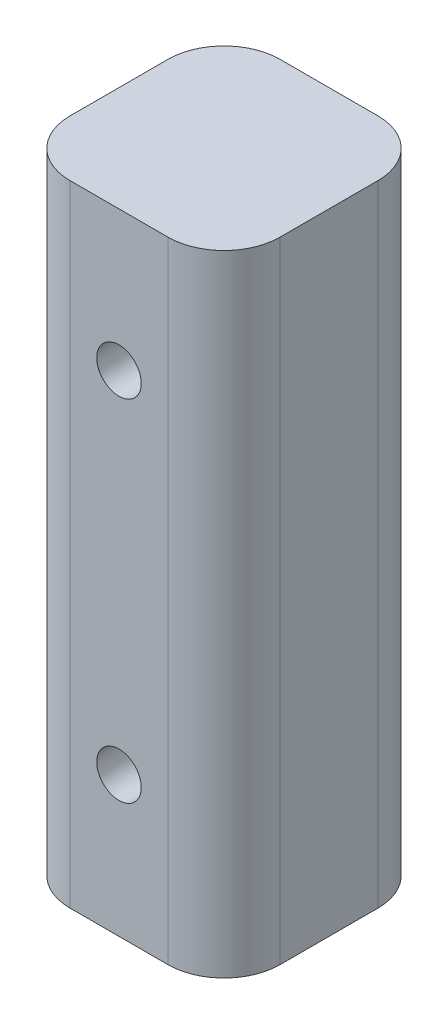
ISO-10303-21;
HEADER;
FILE_DESCRIPTION(('STEP AP214'),'2;1');
FILE_NAME('part.step','',(''),(''),'','','');
FILE_SCHEMA(('AUTOMOTIVE_DESIGN { 1 0 10303 214 1 1 1 1 }'));
ENDSEC;
DATA;
#1=APPLICATION_CONTEXT('core data for automotive mechanical design processes');
#2=APPLICATION_PROTOCOL_DEFINITION('international standard','automotive_design',2000,#1);
#3=PRODUCT_CONTEXT('',#1,'mechanical');
#4=PRODUCT('Part','Part','',(#3));
#5=PRODUCT_RELATED_PRODUCT_CATEGORY('part','',(#4));
#6=PRODUCT_DEFINITION_FORMATION('','',#4);
#7=PRODUCT_DEFINITION_CONTEXT('part definition',#1,'design');
#8=PRODUCT_DEFINITION('design','',#6,#7);
#9=PRODUCT_DEFINITION_SHAPE('','',#8);
#10=(LENGTH_UNIT() NAMED_UNIT(*) SI_UNIT(.MILLI.,.METRE.));
#11=(NAMED_UNIT(*) PLANE_ANGLE_UNIT() SI_UNIT($,.RADIAN.));
#12=(NAMED_UNIT(*) SI_UNIT($,.STERADIAN.) SOLID_ANGLE_UNIT());
#13=UNCERTAINTY_MEASURE_WITH_UNIT(LENGTH_MEASURE(1.E-05),#10,'distance_accuracy_value','');
#14=(GEOMETRIC_REPRESENTATION_CONTEXT(3) GLOBAL_UNCERTAINTY_ASSIGNED_CONTEXT((#13)) GLOBAL_UNIT_ASSIGNED_CONTEXT((#10,
#11,#12)) REPRESENTATION_CONTEXT('',''));
#15=CARTESIAN_POINT('',(0.,0.,0.));
#16=DIRECTION('',(0.,0.,1.));
#17=DIRECTION('',(1.,0.,0.));
#18=AXIS2_PLACEMENT_3D('',#15,#16,#17);
#19=CARTESIAN_POINT('',(-4.445,57.15,-4.445));
#20=DIRECTION('',(0.,-1.,0.));
#21=DIRECTION('',(0.,0.,-1.));
#22=AXIS2_PLACEMENT_3D('',#19,#20,#21);
#23=CYLINDRICAL_SURFACE('',#22,5.08);
#24=CARTESIAN_POINT('',(-4.445,0.,-4.445));
#25=DIRECTION('',(0.,1.,0.));
#26=DIRECTION('',(0.,0.,1.));
#27=AXIS2_PLACEMENT_3D('',#24,#25,#26);
#28=CIRCLE('',#27,5.08);
#29=CARTESIAN_POINT('',(-4.445,0.,-9.525));
#30=VERTEX_POINT('',#29);
#31=CARTESIAN_POINT('',(-9.525,0.,-4.445));
#32=VERTEX_POINT('',#31);
#33=EDGE_CURVE('E131',#30,#32,#28,.T.);
#34=ORIENTED_EDGE('',*,*,#33,.T.);
#35=DIRECTION('',(0.,-1.,0.));
#36=VECTOR('',#35,1.);
#37=CARTESIAN_POINT('',(-9.525,57.15,-4.445));
#38=LINE('',#37,#36);
#39=CARTESIAN_POINT('',(-9.525,57.15,-4.445));
#40=VERTEX_POINT('',#39);
#41=EDGE_CURVE('E11',#40,#32,#38,.T.);
#42=ORIENTED_EDGE('',*,*,#41,.F.);
#43=CARTESIAN_POINT('',(-4.445,57.15,-4.445));
#44=DIRECTION('',(0.,1.,0.));
#45=DIRECTION('',(0.,0.,1.));
#46=AXIS2_PLACEMENT_3D('',#43,#44,#45);
#47=CIRCLE('',#46,5.08);
#48=CARTESIAN_POINT('',(-4.445,57.15,-9.525));
#49=VERTEX_POINT('',#48);
#50=EDGE_CURVE('E146',#49,#40,#47,.T.);
#51=ORIENTED_EDGE('',*,*,#50,.F.);
#52=DIRECTION('',(0.,-1.,0.));
#53=VECTOR('',#52,1.);
#54=CARTESIAN_POINT('',(-4.445,57.15,-9.525));
#55=LINE('',#54,#53);
#56=EDGE_CURVE('E127',#49,#30,#55,.T.);
#57=ORIENTED_EDGE('',*,*,#56,.T.);
#58=EDGE_LOOP('',(#34,#42,#51,#57));
#59=FACE_BOUND('',#58,.T.);
#60=ADVANCED_FACE('F35',(#59),#23,.T.);
#61=CARTESIAN_POINT('',(-9.525,57.15,-4.445));
#62=DIRECTION('',(1.,0.,0.));
#63=DIRECTION('',(0.,0.,-1.));
#64=AXIS2_PLACEMENT_3D('',#61,#62,#63);
#65=PLANE('',#64);
#66=DIRECTION('',(0.,0.,1.));
#67=VECTOR('',#66,1.);
#68=CARTESIAN_POINT('',(-9.525,0.,-4.445));
#69=LINE('',#68,#67);
#70=CARTESIAN_POINT('',(-9.525,0.,4.445));
#71=VERTEX_POINT('',#70);
#72=EDGE_CURVE('E134',#32,#71,#69,.T.);
#73=ORIENTED_EDGE('',*,*,#72,.T.);
#74=DIRECTION('',(0.,-1.,0.));
#75=VECTOR('',#74,1.);
#76=CARTESIAN_POINT('',(-9.525,57.15,4.445));
#77=LINE('',#76,#75);
#78=CARTESIAN_POINT('',(-9.525,57.15,4.445));
#79=VERTEX_POINT('',#78);
#80=EDGE_CURVE('E43',#79,#71,#77,.T.);
#81=ORIENTED_EDGE('',*,*,#80,.F.);
#82=DIRECTION('',(0.,0.,1.));
#83=VECTOR('',#82,1.);
#84=CARTESIAN_POINT('',(-9.525,57.15,-4.445));
#85=LINE('',#84,#83);
#86=EDGE_CURVE('E94',#40,#79,#85,.T.);
#87=ORIENTED_EDGE('',*,*,#86,.F.);
#88=ORIENTED_EDGE('',*,*,#41,.T.);
#89=EDGE_LOOP('',(#73,#81,#87,#88));
#90=FACE_BOUND('',#89,.T.);
#91=ADVANCED_FACE('F212',(#90),#65,.F.);
#92=CARTESIAN_POINT('',(-4.445,57.15,4.445));
#93=DIRECTION('',(0.,-1.,0.));
#94=DIRECTION('',(0.,0.,-1.));
#95=AXIS2_PLACEMENT_3D('',#92,#93,#94);
#96=CYLINDRICAL_SURFACE('',#95,5.08);
#97=CARTESIAN_POINT('',(-4.445,0.,4.445));
#98=DIRECTION('',(0.,1.,0.));
#99=DIRECTION('',(0.,0.,1.));
#100=AXIS2_PLACEMENT_3D('',#97,#98,#99);
#101=CIRCLE('',#100,5.08);
#102=CARTESIAN_POINT('',(-4.445,0.,9.525));
#103=VERTEX_POINT('',#102);
#104=EDGE_CURVE('E137',#71,#103,#101,.T.);
#105=ORIENTED_EDGE('',*,*,#104,.T.);
#106=DIRECTION('',(0.,-1.,0.));
#107=VECTOR('',#106,1.);
#108=CARTESIAN_POINT('',(-4.445,57.15,9.525));
#109=LINE('',#108,#107);
#110=CARTESIAN_POINT('',(-4.445,57.15,9.525));
#111=VERTEX_POINT('',#110);
#112=EDGE_CURVE('E153',#111,#103,#109,.T.);
#113=ORIENTED_EDGE('',*,*,#112,.F.);
#114=CARTESIAN_POINT('',(-4.445,57.15,4.445));
#115=DIRECTION('',(0.,1.,0.));
#116=DIRECTION('',(0.,0.,1.));
#117=AXIS2_PLACEMENT_3D('',#114,#115,#116);
#118=CIRCLE('',#117,5.08);
#119=EDGE_CURVE('E161',#79,#111,#118,.T.);
#120=ORIENTED_EDGE('',*,*,#119,.F.);
#121=ORIENTED_EDGE('',*,*,#80,.T.);
#122=EDGE_LOOP('',(#105,#113,#120,#121));
#123=FACE_BOUND('',#122,.T.);
#124=ADVANCED_FACE('F159',(#123),#96,.T.);
#125=CARTESIAN_POINT('',(-4.445,57.15,9.525));
#126=DIRECTION('',(0.,0.,-1.));
#127=DIRECTION('',(-1.,0.,0.));
#128=AXIS2_PLACEMENT_3D('',#125,#126,#127);
#129=PLANE('',#128);
#130=CARTESIAN_POINT('',(0.,44.45,9.525));
#131=DIRECTION('',(0.,0.,1.));
#132=DIRECTION('',(1.,0.,0.));
#133=AXIS2_PLACEMENT_3D('',#130,#131,#132);
#134=CIRCLE('',#133,2.01929999999999);
#135=CARTESIAN_POINT('',(2.01929999999999,44.45,9.525));
#136=VERTEX_POINT('',#135);
#137=EDGE_CURVE('E187',#136,#136,#134,.T.);
#138=ORIENTED_EDGE('',*,*,#137,.F.);
#139=EDGE_LOOP('',(#138));
#140=FACE_BOUND('',#139,.T.);
#141=CARTESIAN_POINT('',(0.,12.7,9.525));
#142=DIRECTION('',(0.,0.,1.));
#143=DIRECTION('',(1.,0.,0.));
#144=AXIS2_PLACEMENT_3D('',#141,#142,#143);
#145=CIRCLE('',#144,2.01929999999999);
#146=CARTESIAN_POINT('',(2.01929999999999,12.7,9.525));
#147=VERTEX_POINT('',#146);
#148=EDGE_CURVE('E181',#147,#147,#145,.T.);
#149=ORIENTED_EDGE('',*,*,#148,.F.);
#150=EDGE_LOOP('',(#149));
#151=FACE_BOUND('',#150,.T.);
#152=DIRECTION('',(1.,0.,0.));
#153=VECTOR('',#152,1.);
#154=CARTESIAN_POINT('',(-4.445,0.,9.525));
#155=LINE('',#154,#153);
#156=CARTESIAN_POINT('',(4.445,0.,9.525));
#157=VERTEX_POINT('',#156);
#158=EDGE_CURVE('E139',#103,#157,#155,.T.);
#159=ORIENTED_EDGE('',*,*,#158,.T.);
#160=DIRECTION('',(0.,-1.,0.));
#161=VECTOR('',#160,1.);
#162=CARTESIAN_POINT('',(4.445,57.15,9.525));
#163=LINE('',#162,#161);
#164=CARTESIAN_POINT('',(4.445,57.15,9.525));
#165=VERTEX_POINT('',#164);
#166=EDGE_CURVE('E150',#165,#157,#163,.T.);
#167=ORIENTED_EDGE('',*,*,#166,.F.);
#168=DIRECTION('',(1.,0.,0.));
#169=VECTOR('',#168,1.);
#170=CARTESIAN_POINT('',(-4.445,57.15,9.525));
#171=LINE('',#170,#169);
#172=EDGE_CURVE('E173',#111,#165,#171,.T.);
#173=ORIENTED_EDGE('',*,*,#172,.F.);
#174=ORIENTED_EDGE('',*,*,#112,.T.);
#175=EDGE_LOOP('',(#159,#167,#173,#174));
#176=FACE_BOUND('',#175,.T.);
#177=ADVANCED_FACE('F169',(#140,#151,#176),#129,.F.);
#178=CARTESIAN_POINT('',(4.445,57.15,4.445));
#179=DIRECTION('',(0.,-1.,0.));
#180=DIRECTION('',(0.,0.,-1.));
#181=AXIS2_PLACEMENT_3D('',#178,#179,#180);
#182=CYLINDRICAL_SURFACE('',#181,5.08);
#183=CARTESIAN_POINT('',(4.445,0.,4.445));
#184=DIRECTION('',(0.,1.,0.));
#185=DIRECTION('',(0.,0.,1.));
#186=AXIS2_PLACEMENT_3D('',#183,#184,#185);
#187=CIRCLE('',#186,5.08);
#188=CARTESIAN_POINT('',(9.52500000000001,0.,4.445));
#189=VERTEX_POINT('',#188);
#190=EDGE_CURVE('E141',#157,#189,#187,.T.);
#191=ORIENTED_EDGE('',*,*,#190,.T.);
#192=DIRECTION('',(0.,-1.,0.));
#193=VECTOR('',#192,1.);
#194=CARTESIAN_POINT('',(9.52500000000001,57.15,4.445));
#195=LINE('',#194,#193);
#196=CARTESIAN_POINT('',(9.52500000000001,57.15,4.445));
#197=VERTEX_POINT('',#196);
#198=EDGE_CURVE('E122',#197,#189,#195,.T.);
#199=ORIENTED_EDGE('',*,*,#198,.F.);
#200=CARTESIAN_POINT('',(4.445,57.15,4.445));
#201=DIRECTION('',(0.,1.,0.));
#202=DIRECTION('',(0.,0.,1.));
#203=AXIS2_PLACEMENT_3D('',#200,#201,#202);
#204=CIRCLE('',#203,5.08);
#205=EDGE_CURVE('E113',#165,#197,#204,.T.);
#206=ORIENTED_EDGE('',*,*,#205,.F.);
#207=ORIENTED_EDGE('',*,*,#166,.T.);
#208=EDGE_LOOP('',(#191,#199,#206,#207));
#209=FACE_BOUND('',#208,.T.);
#210=ADVANCED_FACE('F172',(#209),#182,.T.);
#211=CARTESIAN_POINT('',(9.525,57.15,-4.445));
#212=DIRECTION('',(-1.,0.,0.));
#213=DIRECTION('',(0.,0.,1.));
#214=AXIS2_PLACEMENT_3D('',#211,#212,#213);
#215=PLANE('',#214);
#216=DIRECTION('',(0.,0.,-1.));
#217=VECTOR('',#216,1.);
#218=CARTESIAN_POINT('',(9.525,0.,-4.445));
#219=LINE('',#218,#217);
#220=CARTESIAN_POINT('',(9.52500000000001,0.,-4.445));
#221=VERTEX_POINT('',#220);
#222=EDGE_CURVE('E121',#189,#221,#219,.T.);
#223=ORIENTED_EDGE('',*,*,#222,.T.);
#224=DIRECTION('',(0.,-1.,0.));
#225=VECTOR('',#224,1.);
#226=CARTESIAN_POINT('',(9.52500000000001,57.15,-4.445));
#227=LINE('',#226,#225);
#228=CARTESIAN_POINT('',(9.52500000000001,57.15,-4.445));
#229=VERTEX_POINT('',#228);
#230=EDGE_CURVE('E118',#229,#221,#227,.T.);
#231=ORIENTED_EDGE('',*,*,#230,.F.);
#232=DIRECTION('',(0.,0.,-1.));
#233=VECTOR('',#232,1.);
#234=CARTESIAN_POINT('',(9.525,57.15,-4.445));
#235=LINE('',#234,#233);
#236=EDGE_CURVE('E107',#197,#229,#235,.T.);
#237=ORIENTED_EDGE('',*,*,#236,.F.);
#238=ORIENTED_EDGE('',*,*,#198,.T.);
#239=EDGE_LOOP('',(#223,#231,#237,#238));
#240=FACE_BOUND('',#239,.T.);
#241=ADVANCED_FACE('F119',(#240),#215,.F.);
#242=CARTESIAN_POINT('',(4.445,57.15,-4.445));
#243=DIRECTION('',(0.,-1.,0.));
#244=DIRECTION('',(0.,0.,-1.));
#245=AXIS2_PLACEMENT_3D('',#242,#243,#244);
#246=CYLINDRICAL_SURFACE('',#245,5.08);
#247=CARTESIAN_POINT('',(4.445,0.,-4.445));
#248=DIRECTION('',(0.,1.,0.));
#249=DIRECTION('',(0.,0.,1.));
#250=AXIS2_PLACEMENT_3D('',#247,#248,#249);
#251=CIRCLE('',#250,5.08);
#252=CARTESIAN_POINT('',(4.445,0.,-9.525));
#253=VERTEX_POINT('',#252);
#254=EDGE_CURVE('E80',#221,#253,#251,.T.);
#255=ORIENTED_EDGE('',*,*,#254,.T.);
#256=DIRECTION('',(0.,-1.,0.));
#257=VECTOR('',#256,1.);
#258=CARTESIAN_POINT('',(4.445,57.15,-9.525));
#259=LINE('',#258,#257);
#260=CARTESIAN_POINT('',(4.445,57.15,-9.525));
#261=VERTEX_POINT('',#260);
#262=EDGE_CURVE('E123',#261,#253,#259,.T.);
#263=ORIENTED_EDGE('',*,*,#262,.F.);
#264=CARTESIAN_POINT('',(4.445,57.15,-4.445));
#265=DIRECTION('',(0.,1.,0.));
#266=DIRECTION('',(0.,0.,1.));
#267=AXIS2_PLACEMENT_3D('',#264,#265,#266);
#268=CIRCLE('',#267,5.08);
#269=EDGE_CURVE('E111',#229,#261,#268,.T.);
#270=ORIENTED_EDGE('',*,*,#269,.F.);
#271=ORIENTED_EDGE('',*,*,#230,.T.);
#272=EDGE_LOOP('',(#255,#263,#270,#271));
#273=FACE_BOUND('',#272,.T.);
#274=ADVANCED_FACE('F125',(#273),#246,.T.);
#275=CARTESIAN_POINT('',(-4.445,57.15,-9.525));
#276=DIRECTION('',(0.,0.,1.));
#277=DIRECTION('',(1.,0.,0.));
#278=AXIS2_PLACEMENT_3D('',#275,#276,#277);
#279=PLANE('',#278);
#280=CARTESIAN_POINT('',(0.,44.45,-9.525));
#281=DIRECTION('',(0.,0.,1.));
#282=DIRECTION('',(1.,0.,0.));
#283=AXIS2_PLACEMENT_3D('',#280,#281,#282);
#284=CIRCLE('',#283,2.0193);
#285=CARTESIAN_POINT('',(2.0193,44.45,-9.525));
#286=VERTEX_POINT('',#285);
#287=EDGE_CURVE('E184',#286,#286,#284,.T.);
#288=ORIENTED_EDGE('',*,*,#287,.T.);
#289=EDGE_LOOP('',(#288));
#290=FACE_BOUND('',#289,.T.);
#291=CARTESIAN_POINT('',(0.,12.7,-9.525));
#292=DIRECTION('',(0.,0.,1.));
#293=DIRECTION('',(1.,0.,0.));
#294=AXIS2_PLACEMENT_3D('',#291,#292,#293);
#295=CIRCLE('',#294,2.0193);
#296=CARTESIAN_POINT('',(2.0193,12.7,-9.525));
#297=VERTEX_POINT('',#296);
#298=EDGE_CURVE('E135',#297,#297,#295,.T.);
#299=ORIENTED_EDGE('',*,*,#298,.T.);
#300=EDGE_LOOP('',(#299));
#301=FACE_BOUND('',#300,.T.);
#302=DIRECTION('',(-1.,0.,0.));
#303=VECTOR('',#302,1.);
#304=CARTESIAN_POINT('',(-4.445,0.,-9.525));
#305=LINE('',#304,#303);
#306=EDGE_CURVE('E86',#253,#30,#305,.T.);
#307=ORIENTED_EDGE('',*,*,#306,.T.);
#308=ORIENTED_EDGE('',*,*,#56,.F.);
#309=DIRECTION('',(-1.,0.,0.));
#310=VECTOR('',#309,1.);
#311=CARTESIAN_POINT('',(-4.445,57.15,-9.525));
#312=LINE('',#311,#310);
#313=EDGE_CURVE('E51',#261,#49,#312,.T.);
#314=ORIENTED_EDGE('',*,*,#313,.F.);
#315=ORIENTED_EDGE('',*,*,#262,.T.);
#316=EDGE_LOOP('',(#307,#308,#314,#315));
#317=FACE_BOUND('',#316,.T.);
#318=ADVANCED_FACE('F219',(#290,#301,#317),#279,.F.);
#319=CARTESIAN_POINT('',(-4.445,57.15,-4.445));
#320=DIRECTION('',(0.,1.,0.));
#321=DIRECTION('',(0.,0.,1.));
#322=AXIS2_PLACEMENT_3D('',#319,#320,#321);
#323=PLANE('',#322);
#324=ORIENTED_EDGE('',*,*,#50,.T.);
#325=ORIENTED_EDGE('',*,*,#86,.T.);
#326=ORIENTED_EDGE('',*,*,#119,.T.);
#327=ORIENTED_EDGE('',*,*,#172,.T.);
#328=ORIENTED_EDGE('',*,*,#205,.T.);
#329=ORIENTED_EDGE('',*,*,#236,.T.);
#330=ORIENTED_EDGE('',*,*,#269,.T.);
#331=ORIENTED_EDGE('',*,*,#313,.T.);
#332=EDGE_LOOP('',(#324,#325,#326,#327,#328,#329,#330,#331));
#333=FACE_BOUND('',#332,.T.);
#334=ADVANCED_FACE('F109',(#333),#323,.T.);
#335=CARTESIAN_POINT('',(-4.445,0.,-4.445));
#336=DIRECTION('',(0.,1.,0.));
#337=DIRECTION('',(0.,0.,1.));
#338=AXIS2_PLACEMENT_3D('',#335,#336,#337);
#339=PLANE('',#338);
#340=ORIENTED_EDGE('',*,*,#33,.F.);
#341=ORIENTED_EDGE('',*,*,#306,.F.);
#342=ORIENTED_EDGE('',*,*,#254,.F.);
#343=ORIENTED_EDGE('',*,*,#222,.F.);
#344=ORIENTED_EDGE('',*,*,#190,.F.);
#345=ORIENTED_EDGE('',*,*,#158,.F.);
#346=ORIENTED_EDGE('',*,*,#104,.F.);
#347=ORIENTED_EDGE('',*,*,#72,.F.);
#348=EDGE_LOOP('',(#340,#341,#342,#343,#344,#345,#346,#347));
#349=FACE_BOUND('',#348,.T.);
#350=ADVANCED_FACE('F165',(#349),#339,.F.);
#351=CARTESIAN_POINT('',(0.,12.7,9.525));
#352=DIRECTION('',(0.,0.,1.));
#353=DIRECTION('',(1.,0.,0.));
#354=AXIS2_PLACEMENT_3D('',#351,#352,#353);
#355=CYLINDRICAL_SURFACE('',#354,2.01929999999999);
#356=ORIENTED_EDGE('',*,*,#298,.F.);
#357=EDGE_LOOP('',(#356));
#358=FACE_BOUND('',#357,.T.);
#359=ORIENTED_EDGE('',*,*,#148,.T.);
#360=EDGE_LOOP('',(#359));
#361=FACE_BOUND('',#360,.T.);
#362=ADVANCED_FACE('F198',(#358,#361),#355,.F.);
#363=CARTESIAN_POINT('',(0.,44.45,9.525));
#364=DIRECTION('',(0.,0.,1.));
#365=DIRECTION('',(1.,0.,0.));
#366=AXIS2_PLACEMENT_3D('',#363,#364,#365);
#367=CYLINDRICAL_SURFACE('',#366,2.01929999999999);
#368=ORIENTED_EDGE('',*,*,#287,.F.);
#369=EDGE_LOOP('',(#368));
#370=FACE_BOUND('',#369,.T.);
#371=ORIENTED_EDGE('',*,*,#137,.T.);
#372=EDGE_LOOP('',(#371));
#373=FACE_BOUND('',#372,.T.);
#374=ADVANCED_FACE('F191',(#370,#373),#367,.F.);
#375=CLOSED_SHELL('',(#60,#91,#124,#177,#210,#241,#274,#318,#334,#350,#362,#374));
#376=MANIFOLD_SOLID_BREP('B2',#375);
#377=ADVANCED_BREP_SHAPE_REPRESENTATION('',(#18,#376),#14);
#378=SHAPE_DEFINITION_REPRESENTATION(#9,#377);
ENDSEC;
END-ISO-10303-21;
